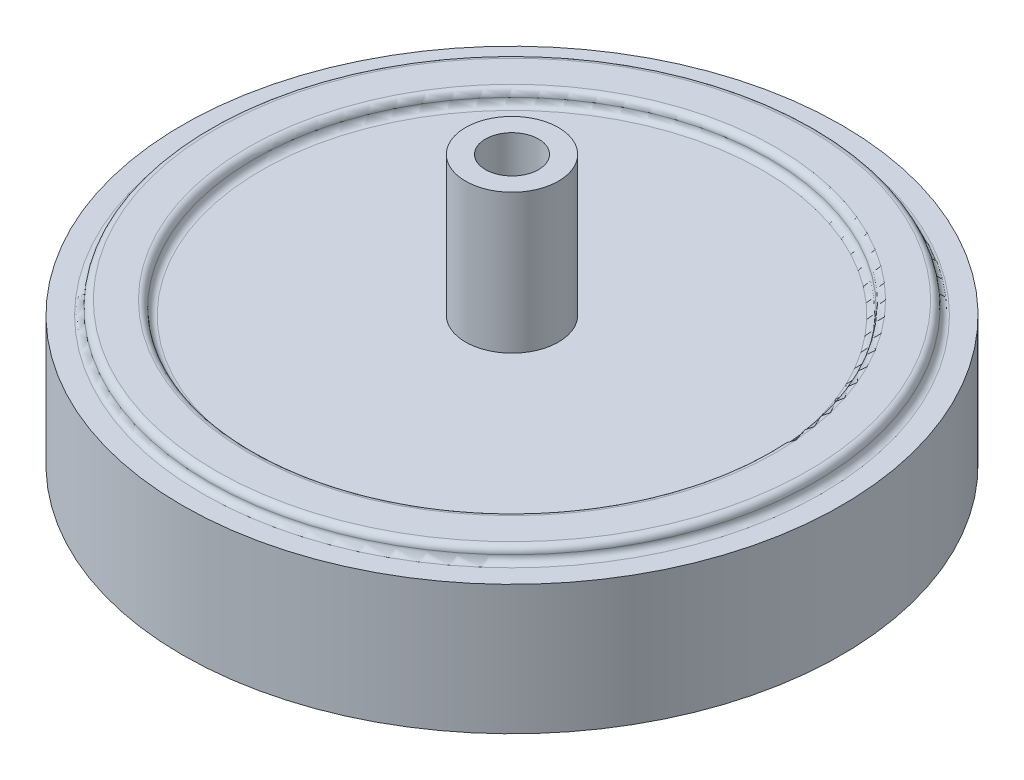
ISO-10303-21;
HEADER;
FILE_DESCRIPTION(('STEP AP214'),'2;1');
FILE_NAME('part.step','',(''),(''),'','','');
FILE_SCHEMA(('AUTOMOTIVE_DESIGN { 1 0 10303 214 1 1 1 1 }'));
ENDSEC;
DATA;
#1=APPLICATION_CONTEXT('core data for automotive mechanical design processes');
#2=APPLICATION_PROTOCOL_DEFINITION('international standard','automotive_design',2000,#1);
#3=PRODUCT_CONTEXT('',#1,'mechanical');
#4=PRODUCT('Part','Part','',(#3));
#5=PRODUCT_RELATED_PRODUCT_CATEGORY('part','',(#4));
#6=PRODUCT_DEFINITION_FORMATION('','',#4);
#7=PRODUCT_DEFINITION_CONTEXT('part definition',#1,'design');
#8=PRODUCT_DEFINITION('design','',#6,#7);
#9=PRODUCT_DEFINITION_SHAPE('','',#8);
#10=(LENGTH_UNIT() NAMED_UNIT(*) SI_UNIT(.MILLI.,.METRE.));
#11=(NAMED_UNIT(*) PLANE_ANGLE_UNIT() SI_UNIT($,.RADIAN.));
#12=(NAMED_UNIT(*) SI_UNIT($,.STERADIAN.) SOLID_ANGLE_UNIT());
#13=UNCERTAINTY_MEASURE_WITH_UNIT(LENGTH_MEASURE(1.E-05),#10,'distance_accuracy_value','');
#14=(GEOMETRIC_REPRESENTATION_CONTEXT(3) GLOBAL_UNCERTAINTY_ASSIGNED_CONTEXT((#13)) GLOBAL_UNIT_ASSIGNED_CONTEXT((#10,
#11,#12)) REPRESENTATION_CONTEXT('',''));
#15=CARTESIAN_POINT('',(0.,0.,0.));
#16=DIRECTION('',(0.,0.,1.));
#17=DIRECTION('',(1.,0.,0.));
#18=AXIS2_PLACEMENT_3D('',#15,#16,#17);
#19=CARTESIAN_POINT('',(0.,-1.5,0.));
#20=DIRECTION('',(0.,-1.,0.));
#21=DIRECTION('',(0.,0.,-1.));
#22=AXIS2_PLACEMENT_3D('',#19,#20,#21);
#23=CYLINDRICAL_SURFACE('',#22,22.);
#24=CARTESIAN_POINT('',(0.,-10.5,0.));
#25=DIRECTION('',(0.,-1.,0.));
#26=DIRECTION('',(0.,0.,-1.));
#27=AXIS2_PLACEMENT_3D('',#24,#25,#26);
#28=CIRCLE('',#27,22.);
#29=CARTESIAN_POINT('',(0.,-10.5,-22.));
#30=VERTEX_POINT('',#29);
#31=EDGE_CURVE('E173',#30,#30,#28,.F.);
#32=ORIENTED_EDGE('',*,*,#31,.F.);
#33=EDGE_LOOP('',(#32));
#34=FACE_BOUND('',#33,.T.);
#35=CARTESIAN_POINT('',(0.,-1.5,0.));
#36=DIRECTION('',(0.,-1.,0.));
#37=DIRECTION('',(0.,0.,-1.));
#38=AXIS2_PLACEMENT_3D('',#35,#36,#37);
#39=CIRCLE('',#38,22.);
#40=CARTESIAN_POINT('',(0.,-1.5,-22.));
#41=VERTEX_POINT('',#40);
#42=EDGE_CURVE('E176',#41,#41,#39,.T.);
#43=ORIENTED_EDGE('',*,*,#42,.F.);
#44=EDGE_LOOP('',(#43));
#45=FACE_BOUND('',#44,.T.);
#46=ADVANCED_FACE('F17',(#34,#45),#23,.F.);
#47=CARTESIAN_POINT('',(0.,-1.5,0.));
#48=DIRECTION('',(0.,-1.,0.));
#49=DIRECTION('',(0.,0.,-1.));
#50=AXIS2_PLACEMENT_3D('',#47,#48,#49);
#51=PLANE('',#50);
#52=CARTESIAN_POINT('',(0.,-1.5,0.));
#53=DIRECTION('',(0.,1.,0.));
#54=DIRECTION('',(0.,0.,1.));
#55=AXIS2_PLACEMENT_3D('',#52,#53,#54);
#56=CIRCLE('',#55,18.);
#57=CARTESIAN_POINT('',(0.,-1.5,18.));
#58=VERTEX_POINT('',#57);
#59=EDGE_CURVE('E170',#58,#58,#56,.F.);
#60=ORIENTED_EDGE('',*,*,#59,.F.);
#61=EDGE_LOOP('',(#60));
#62=FACE_BOUND('',#61,.T.);
#63=ORIENTED_EDGE('',*,*,#42,.T.);
#64=EDGE_LOOP('',(#63));
#65=FACE_BOUND('',#64,.T.);
#66=ADVANCED_FACE('F422',(#62,#65),#51,.T.);
#67=CARTESIAN_POINT('',(0.,-10.5,0.));
#68=DIRECTION('',(0.,-1.,0.));
#69=DIRECTION('',(0.,0.,-1.));
#70=AXIS2_PLACEMENT_3D('',#67,#68,#69);
#71=PLANE('',#70);
#72=ORIENTED_EDGE('',*,*,#31,.T.);
#73=EDGE_LOOP('',(#72));
#74=FACE_BOUND('',#73,.T.);
#75=CARTESIAN_POINT('',(0.,-10.5,0.));
#76=DIRECTION('',(0.,1.,0.));
#77=DIRECTION('',(0.,0.,1.));
#78=AXIS2_PLACEMENT_3D('',#75,#76,#77);
#79=CIRCLE('',#78,22.0259618943234);
#80=CARTESIAN_POINT('',(0.,-10.5,22.0259618943234));
#81=VERTEX_POINT('',#80);
#82=EDGE_CURVE('E167',#81,#81,#79,.T.);
#83=ORIENTED_EDGE('',*,*,#82,.F.);
#84=EDGE_LOOP('',(#83));
#85=FACE_BOUND('',#84,.T.);
#86=ADVANCED_FACE('F412',(#74,#85),#71,.T.);
#87=CARTESIAN_POINT('',(0.,-2.5,0.));
#88=DIRECTION('',(0.,1.,0.));
#89=DIRECTION('',(0.,0.,1.));
#90=AXIS2_PLACEMENT_3D('',#87,#88,#89);
#91=CYLINDRICAL_SURFACE('',#90,18.);
#92=ORIENTED_EDGE('',*,*,#59,.T.);
#93=EDGE_LOOP('',(#92));
#94=FACE_BOUND('',#93,.T.);
#95=CARTESIAN_POINT('',(0.,-2.5,0.));
#96=DIRECTION('',(0.,1.,0.));
#97=DIRECTION('',(0.,0.,1.));
#98=AXIS2_PLACEMENT_3D('',#95,#96,#97);
#99=CIRCLE('',#98,18.);
#100=CARTESIAN_POINT('',(0.,-2.5,18.));
#101=VERTEX_POINT('',#100);
#102=EDGE_CURVE('E164',#101,#101,#99,.F.);
#103=ORIENTED_EDGE('',*,*,#102,.F.);
#104=EDGE_LOOP('',(#103));
#105=FACE_BOUND('',#104,.T.);
#106=ADVANCED_FACE('F402',(#94,#105),#91,.T.);
#107=CARTESIAN_POINT('',(0.,-9.75,0.));
#108=DIRECTION('',(0.,1.,0.));
#109=DIRECTION('',(0.,0.,1.));
#110=AXIS2_PLACEMENT_3D('',#107,#108,#109);
#111=CONICAL_SURFACE('',#110,24.825,1.30899693899574);
#112=ORIENTED_EDGE('',*,*,#82,.T.);
#113=EDGE_LOOP('',(#112));
#114=FACE_BOUND('',#113,.T.);
#115=CARTESIAN_POINT('',(0.,-9.75,0.));
#116=DIRECTION('',(0.,1.,0.));
#117=DIRECTION('',(0.,0.,1.));
#118=AXIS2_PLACEMENT_3D('',#115,#116,#117);
#119=CIRCLE('',#118,24.825);
#120=CARTESIAN_POINT('',(0.,-9.75,24.825));
#121=VERTEX_POINT('',#120);
#122=EDGE_CURVE('E101',#121,#121,#119,.T.);
#123=ORIENTED_EDGE('',*,*,#122,.F.);
#124=EDGE_LOOP('',(#123));
#125=FACE_BOUND('',#124,.T.);
#126=ADVANCED_FACE('F392',(#114,#125),#111,.T.);
#127=CARTESIAN_POINT('',(0.,-2.5,0.));
#128=DIRECTION('',(0.,-1.,0.));
#129=DIRECTION('',(0.,0.,-1.));
#130=AXIS2_PLACEMENT_3D('',#127,#128,#129);
#131=PLANE('',#130);
#132=CARTESIAN_POINT('',(0.,-2.5,0.));
#133=DIRECTION('',(0.,1.,0.));
#134=DIRECTION('',(0.,0.,1.));
#135=AXIS2_PLACEMENT_3D('',#132,#133,#134);
#136=CIRCLE('',#135,5.);
#137=CARTESIAN_POINT('',(0.,-2.5,5.));
#138=VERTEX_POINT('',#137);
#139=EDGE_CURVE('E161',#138,#138,#136,.F.);
#140=ORIENTED_EDGE('',*,*,#139,.F.);
#141=EDGE_LOOP('',(#140));
#142=FACE_BOUND('',#141,.T.);
#143=ORIENTED_EDGE('',*,*,#102,.T.);
#144=EDGE_LOOP('',(#143));
#145=FACE_BOUND('',#144,.T.);
#146=ADVANCED_FACE('F383',(#142,#145),#131,.T.);
#147=CARTESIAN_POINT('',(0.,-10.5,0.));
#148=DIRECTION('',(0.,1.,0.));
#149=DIRECTION('',(0.,0.,1.));
#150=AXIS2_PLACEMENT_3D('',#147,#148,#149);
#151=CYLINDRICAL_SURFACE('',#150,24.825);
#152=ORIENTED_EDGE('',*,*,#122,.T.);
#153=EDGE_LOOP('',(#152));
#154=FACE_BOUND('',#153,.T.);
#155=CARTESIAN_POINT('',(0.,0.,0.));
#156=DIRECTION('',(0.,1.,0.));
#157=DIRECTION('',(0.,0.,1.));
#158=AXIS2_PLACEMENT_3D('',#155,#156,#157);
#159=CIRCLE('',#158,24.825);
#160=CARTESIAN_POINT('',(0.,0.,24.825));
#161=VERTEX_POINT('',#160);
#162=EDGE_CURVE('E158',#161,#161,#159,.F.);
#163=ORIENTED_EDGE('',*,*,#162,.T.);
#164=EDGE_LOOP('',(#163));
#165=FACE_BOUND('',#164,.T.);
#166=ADVANCED_FACE('F374',(#154,#165),#151,.T.);
#167=CARTESIAN_POINT('',(0.,-6.65,0.));
#168=DIRECTION('',(0.,1.,0.));
#169=DIRECTION('',(0.,0.,1.));
#170=AXIS2_PLACEMENT_3D('',#167,#168,#169);
#171=CYLINDRICAL_SURFACE('',#170,5.);
#172=ORIENTED_EDGE('',*,*,#139,.T.);
#173=EDGE_LOOP('',(#172));
#174=FACE_BOUND('',#173,.T.);
#175=CARTESIAN_POINT('',(0.,-6.65,0.));
#176=DIRECTION('',(0.,1.,0.));
#177=DIRECTION('',(0.,0.,1.));
#178=AXIS2_PLACEMENT_3D('',#175,#176,#177);
#179=CIRCLE('',#178,5.);
#180=CARTESIAN_POINT('',(0.,-6.65,5.));
#181=VERTEX_POINT('',#180);
#182=EDGE_CURVE('E63',#181,#181,#179,.F.);
#183=ORIENTED_EDGE('',*,*,#182,.F.);
#184=EDGE_LOOP('',(#183));
#185=FACE_BOUND('',#184,.T.);
#186=ADVANCED_FACE('F86',(#174,#185),#171,.T.);
#187=CARTESIAN_POINT('',(0.,0.,0.));
#188=DIRECTION('',(0.,-1.,0.));
#189=DIRECTION('',(0.,0.,-1.));
#190=AXIS2_PLACEMENT_3D('',#187,#188,#189);
#191=PLANE('',#190);
#192=ORIENTED_EDGE('',*,*,#162,.F.);
#193=EDGE_LOOP('',(#192));
#194=FACE_BOUND('',#193,.T.);
#195=CARTESIAN_POINT('',(0.,0.,0.));
#196=DIRECTION('',(0.,1.,0.));
#197=DIRECTION('',(0.,0.,-1.));
#198=AXIS2_PLACEMENT_3D('',#195,#196,#197);
#199=CIRCLE('',#198,23.3);
#200=CARTESIAN_POINT('',(0.,0.,23.3));
#201=VERTEX_POINT('',#200);
#202=CARTESIAN_POINT('',(0.,0.,-23.3));
#203=VERTEX_POINT('',#202);
#204=EDGE_CURVE('E61',#201,#203,#199,.F.);
#205=ORIENTED_EDGE('',*,*,#204,.T.);
#206=CARTESIAN_POINT('',(0.,0.,0.));
#207=DIRECTION('',(0.,1.,0.));
#208=DIRECTION('',(0.,0.,1.));
#209=AXIS2_PLACEMENT_3D('',#206,#207,#208);
#210=CIRCLE('',#209,23.3);
#211=EDGE_CURVE('E56',#203,#201,#210,.F.);
#212=ORIENTED_EDGE('',*,*,#211,.T.);
#213=EDGE_LOOP('',(#205,#212));
#214=FACE_BOUND('',#213,.T.);
#215=ADVANCED_FACE('F66',(#194,#214),#191,.F.);
#216=CARTESIAN_POINT('',(0.,-6.65,0.));
#217=DIRECTION('',(0.,-1.,0.));
#218=DIRECTION('',(0.,0.,-1.));
#219=AXIS2_PLACEMENT_3D('',#216,#217,#218);
#220=PLANE('',#219);
#221=CARTESIAN_POINT('',(0.,-6.65,0.));
#222=DIRECTION('',(0.,1.,0.));
#223=DIRECTION('',(0.,0.,1.));
#224=AXIS2_PLACEMENT_3D('',#221,#222,#223);
#225=CIRCLE('',#224,3.425);
#226=CARTESIAN_POINT('',(0.,-6.65,3.425));
#227=VERTEX_POINT('',#226);
#228=EDGE_CURVE('E67',#227,#227,#225,.F.);
#229=ORIENTED_EDGE('',*,*,#228,.F.);
#230=EDGE_LOOP('',(#229));
#231=FACE_BOUND('',#230,.T.);
#232=ORIENTED_EDGE('',*,*,#182,.T.);
#233=EDGE_LOOP('',(#232));
#234=FACE_BOUND('',#233,.T.);
#235=ADVANCED_FACE('F85',(#231,#234),#220,.T.);
#236=CARTESIAN_POINT('',(0.,0.5,0.));
#237=DIRECTION('',(0.,-1.,0.));
#238=DIRECTION('',(0.,0.,-1.));
#239=AXIS2_PLACEMENT_3D('',#236,#237,#238);
#240=TOROIDAL_SURFACE('',#239,23.3,0.5);
#241=CARTESIAN_POINT('',(0.,0.5,0.));
#242=DIRECTION('',(0.,1.,0.));
#243=DIRECTION('',(0.,0.,1.));
#244=AXIS2_PLACEMENT_3D('',#241,#242,#243);
#245=CIRCLE('',#244,22.8);
#246=CARTESIAN_POINT('',(0.,0.5,22.8));
#247=VERTEX_POINT('',#246);
#248=EDGE_CURVE('E139',#247,#247,#245,.T.);
#249=ORIENTED_EDGE('',*,*,#248,.F.);
#250=EDGE_LOOP('',(#249));
#251=FACE_BOUND('',#250,.T.);
#252=ORIENTED_EDGE('',*,*,#204,.F.);
#253=ORIENTED_EDGE('',*,*,#211,.F.);
#254=EDGE_LOOP('',(#252,#253));
#255=FACE_BOUND('',#254,.T.);
#256=ADVANCED_FACE('F60',(#251,#255),#240,.F.);
#257=CARTESIAN_POINT('',(0.,-14.65,0.));
#258=DIRECTION('',(0.,1.,0.));
#259=DIRECTION('',(0.,0.,1.));
#260=AXIS2_PLACEMENT_3D('',#257,#258,#259);
#261=CYLINDRICAL_SURFACE('',#260,3.425);
#262=ORIENTED_EDGE('',*,*,#228,.T.);
#263=EDGE_LOOP('',(#262));
#264=FACE_BOUND('',#263,.T.);
#265=CARTESIAN_POINT('',(0.,-14.65,0.));
#266=DIRECTION('',(0.,1.,0.));
#267=DIRECTION('',(0.,0.,1.));
#268=AXIS2_PLACEMENT_3D('',#265,#266,#267);
#269=CIRCLE('',#268,3.425);
#270=CARTESIAN_POINT('',(0.,-14.65,3.425));
#271=VERTEX_POINT('',#270);
#272=EDGE_CURVE('E146',#271,#271,#269,.F.);
#273=ORIENTED_EDGE('',*,*,#272,.F.);
#274=EDGE_LOOP('',(#273));
#275=FACE_BOUND('',#274,.T.);
#276=ADVANCED_FACE('F110',(#264,#275),#261,.T.);
#277=CARTESIAN_POINT('',(0.,0.5,0.));
#278=DIRECTION('',(0.,1.,0.));
#279=DIRECTION('',(0.,0.,1.));
#280=AXIS2_PLACEMENT_3D('',#277,#278,#279);
#281=TOROIDAL_SURFACE('',#280,22.3,0.5);
#282=ORIENTED_EDGE('',*,*,#248,.T.);
#283=EDGE_LOOP('',(#282));
#284=FACE_BOUND('',#283,.T.);
#285=CARTESIAN_POINT('',(0.,1.,0.));
#286=DIRECTION('',(0.,-1.,0.));
#287=DIRECTION('',(0.,0.,1.));
#288=AXIS2_PLACEMENT_3D('',#285,#286,#287);
#289=CIRCLE('',#288,22.3);
#290=CARTESIAN_POINT('',(0.,1.,-22.3));
#291=VERTEX_POINT('',#290);
#292=CARTESIAN_POINT('',(0.,1.,22.3));
#293=VERTEX_POINT('',#292);
#294=EDGE_CURVE('E136',#291,#293,#289,.F.);
#295=ORIENTED_EDGE('',*,*,#294,.F.);
#296=CARTESIAN_POINT('',(0.,1.,0.));
#297=DIRECTION('',(0.,-1.,0.));
#298=DIRECTION('',(0.,0.,-1.));
#299=AXIS2_PLACEMENT_3D('',#296,#297,#298);
#300=CIRCLE('',#299,22.3);
#301=EDGE_CURVE('E149',#293,#291,#300,.F.);
#302=ORIENTED_EDGE('',*,*,#301,.F.);
#303=EDGE_LOOP('',(#295,#302));
#304=FACE_BOUND('',#303,.T.);
#305=ADVANCED_FACE('F115',(#284,#304),#281,.T.);
#306=CARTESIAN_POINT('',(0.,-14.65,0.));
#307=DIRECTION('',(0.,-1.,0.));
#308=DIRECTION('',(0.,0.,-1.));
#309=AXIS2_PLACEMENT_3D('',#306,#307,#308);
#310=PLANE('',#309);
#311=ORIENTED_EDGE('',*,*,#272,.T.);
#312=EDGE_LOOP('',(#311));
#313=FACE_BOUND('',#312,.T.);
#314=CARTESIAN_POINT('',(0.,-14.65,0.));
#315=DIRECTION('',(0.,-1.,0.));
#316=DIRECTION('',(0.,0.,-1.));
#317=AXIS2_PLACEMENT_3D('',#314,#315,#316);
#318=CIRCLE('',#317,2.);
#319=CARTESIAN_POINT('',(0.,-14.65,-2.));
#320=VERTEX_POINT('',#319);
#321=EDGE_CURVE('E244',#320,#320,#318,.F.);
#322=ORIENTED_EDGE('',*,*,#321,.T.);
#323=EDGE_LOOP('',(#322));
#324=FACE_BOUND('',#323,.T.);
#325=ADVANCED_FACE('F121',(#313,#324),#310,.T.);
#326=CARTESIAN_POINT('',(0.,1.,0.));
#327=DIRECTION('',(0.,1.,0.));
#328=DIRECTION('',(0.,0.,1.));
#329=AXIS2_PLACEMENT_3D('',#326,#327,#328);
#330=PLANE('',#329);
#331=ORIENTED_EDGE('',*,*,#301,.T.);
#332=ORIENTED_EDGE('',*,*,#294,.T.);
#333=EDGE_LOOP('',(#331,#332));
#334=FACE_BOUND('',#333,.T.);
#335=CARTESIAN_POINT('',(0.,1.,0.));
#336=DIRECTION('',(0.,1.,0.));
#337=DIRECTION('',(0.,0.,-1.));
#338=AXIS2_PLACEMENT_3D('',#335,#336,#337);
#339=CIRCLE('',#338,19.9);
#340=CARTESIAN_POINT('',(0.,1.,-19.9));
#341=VERTEX_POINT('',#340);
#342=CARTESIAN_POINT('',(0.,1.,19.9));
#343=VERTEX_POINT('',#342);
#344=EDGE_CURVE('E250',#341,#343,#339,.T.);
#345=ORIENTED_EDGE('',*,*,#344,.F.);
#346=CARTESIAN_POINT('',(0.,1.,0.));
#347=DIRECTION('',(0.,1.,0.));
#348=DIRECTION('',(0.,0.,1.));
#349=AXIS2_PLACEMENT_3D('',#346,#347,#348);
#350=CIRCLE('',#349,19.9);
#351=EDGE_CURVE('E247',#343,#341,#350,.T.);
#352=ORIENTED_EDGE('',*,*,#351,.F.);
#353=EDGE_LOOP('',(#345,#352));
#354=FACE_BOUND('',#353,.T.);
#355=ADVANCED_FACE('F318',(#334,#354),#330,.T.);
#356=CARTESIAN_POINT('',(0.,10.5,0.));
#357=DIRECTION('',(0.,-1.,0.));
#358=DIRECTION('',(0.,0.,-1.));
#359=AXIS2_PLACEMENT_3D('',#356,#357,#358);
#360=CYLINDRICAL_SURFACE('',#359,2.);
#361=CARTESIAN_POINT('',(0.,10.5,0.));
#362=DIRECTION('',(0.,-1.,0.));
#363=DIRECTION('',(0.,0.,-1.));
#364=AXIS2_PLACEMENT_3D('',#361,#362,#363);
#365=CIRCLE('',#364,2.);
#366=CARTESIAN_POINT('',(0.,10.5,-2.));
#367=VERTEX_POINT('',#366);
#368=EDGE_CURVE('E252',#367,#367,#365,.T.);
#369=ORIENTED_EDGE('',*,*,#368,.F.);
#370=EDGE_LOOP('',(#369));
#371=FACE_BOUND('',#370,.T.);
#372=ORIENTED_EDGE('',*,*,#321,.F.);
#373=EDGE_LOOP('',(#372));
#374=FACE_BOUND('',#373,.T.);
#375=ADVANCED_FACE('F224',(#371,#374),#360,.F.);
#376=CARTESIAN_POINT('',(0.,0.5,0.));
#377=DIRECTION('',(0.,1.,0.));
#378=DIRECTION('',(0.,0.,1.));
#379=AXIS2_PLACEMENT_3D('',#376,#377,#378);
#380=TOROIDAL_SURFACE('',#379,19.9,0.5);
#381=ORIENTED_EDGE('',*,*,#351,.T.);
#382=ORIENTED_EDGE('',*,*,#344,.T.);
#383=EDGE_LOOP('',(#381,#382));
#384=FACE_BOUND('',#383,.T.);
#385=CARTESIAN_POINT('',(0.,0.5,0.));
#386=DIRECTION('',(0.,-1.,0.));
#387=DIRECTION('',(0.,0.,-1.));
#388=AXIS2_PLACEMENT_3D('',#385,#386,#387);
#389=CIRCLE('',#388,19.4);
#390=CARTESIAN_POINT('',(0.,0.5,-19.4));
#391=VERTEX_POINT('',#390);
#392=EDGE_CURVE('E218',#391,#391,#389,.T.);
#393=ORIENTED_EDGE('',*,*,#392,.T.);
#394=EDGE_LOOP('',(#393));
#395=FACE_BOUND('',#394,.T.);
#396=ADVANCED_FACE('F220',(#384,#395),#380,.T.);
#397=CARTESIAN_POINT('',(0.,10.5,0.));
#398=DIRECTION('',(0.,1.,0.));
#399=DIRECTION('',(0.,0.,1.));
#400=AXIS2_PLACEMENT_3D('',#397,#398,#399);
#401=PLANE('',#400);
#402=ORIENTED_EDGE('',*,*,#368,.T.);
#403=EDGE_LOOP('',(#402));
#404=FACE_BOUND('',#403,.T.);
#405=CARTESIAN_POINT('',(0.,10.5,0.));
#406=DIRECTION('',(0.,-1.,0.));
#407=DIRECTION('',(0.,0.,-1.));
#408=AXIS2_PLACEMENT_3D('',#405,#406,#407);
#409=CIRCLE('',#408,3.5);
#410=CARTESIAN_POINT('',(0.,10.5,-3.5));
#411=VERTEX_POINT('',#410);
#412=EDGE_CURVE('E255',#411,#411,#409,.T.);
#413=ORIENTED_EDGE('',*,*,#412,.F.);
#414=EDGE_LOOP('',(#413));
#415=FACE_BOUND('',#414,.T.);
#416=ADVANCED_FACE('F199',(#404,#415),#401,.T.);
#417=CARTESIAN_POINT('',(0.,0.5,0.));
#418=DIRECTION('',(0.,-1.,0.));
#419=DIRECTION('',(0.,0.,-1.));
#420=AXIS2_PLACEMENT_3D('',#417,#418,#419);
#421=TOROIDAL_SURFACE('',#420,18.9,0.5);
#422=CARTESIAN_POINT('',(0.,0.,0.));
#423=DIRECTION('',(0.,-1.,0.));
#424=DIRECTION('',(0.,0.,1.));
#425=AXIS2_PLACEMENT_3D('',#422,#423,#424);
#426=CIRCLE('',#425,18.9);
#427=CARTESIAN_POINT('',(0.,0.,18.9));
#428=VERTEX_POINT('',#427);
#429=CARTESIAN_POINT('',(0.,0.,-18.9));
#430=VERTEX_POINT('',#429);
#431=EDGE_CURVE('E28',#428,#430,#426,.T.);
#432=ORIENTED_EDGE('',*,*,#431,.T.);
#433=CARTESIAN_POINT('',(0.,0.,0.));
#434=DIRECTION('',(0.,-1.,0.));
#435=DIRECTION('',(0.,0.,-1.));
#436=AXIS2_PLACEMENT_3D('',#433,#434,#435);
#437=CIRCLE('',#436,18.9);
#438=EDGE_CURVE('E181',#430,#428,#437,.T.);
#439=ORIENTED_EDGE('',*,*,#438,.T.);
#440=EDGE_LOOP('',(#432,#439));
#441=FACE_BOUND('',#440,.T.);
#442=ORIENTED_EDGE('',*,*,#392,.F.);
#443=EDGE_LOOP('',(#442));
#444=FACE_BOUND('',#443,.T.);
#445=ADVANCED_FACE('F187',(#441,#444),#421,.F.);
#446=CARTESIAN_POINT('',(0.,10.5,0.));
#447=DIRECTION('',(0.,-1.,0.));
#448=DIRECTION('',(0.,0.,-1.));
#449=AXIS2_PLACEMENT_3D('',#446,#447,#448);
#450=CYLINDRICAL_SURFACE('',#449,3.5);
#451=CARTESIAN_POINT('',(0.,0.,0.));
#452=DIRECTION('',(0.,-1.,0.));
#453=DIRECTION('',(0.,0.,-1.));
#454=AXIS2_PLACEMENT_3D('',#451,#452,#453);
#455=CIRCLE('',#454,3.5);
#456=CARTESIAN_POINT('',(0.,0.,-3.5));
#457=VERTEX_POINT('',#456);
#458=EDGE_CURVE('E11',#457,#457,#455,.F.);
#459=ORIENTED_EDGE('',*,*,#458,.T.);
#460=EDGE_LOOP('',(#459));
#461=FACE_BOUND('',#460,.T.);
#462=ORIENTED_EDGE('',*,*,#412,.T.);
#463=EDGE_LOOP('',(#462));
#464=FACE_BOUND('',#463,.T.);
#465=ADVANCED_FACE('F198',(#461,#464),#450,.T.);
#466=CARTESIAN_POINT('',(0.,0.,0.));
#467=DIRECTION('',(0.,-1.,0.));
#468=DIRECTION('',(0.,0.,-1.));
#469=AXIS2_PLACEMENT_3D('',#466,#467,#468);
#470=PLANE('',#469);
#471=ORIENTED_EDGE('',*,*,#458,.F.);
#472=EDGE_LOOP('',(#471));
#473=FACE_BOUND('',#472,.T.);
#474=ORIENTED_EDGE('',*,*,#438,.F.);
#475=ORIENTED_EDGE('',*,*,#431,.F.);
#476=EDGE_LOOP('',(#474,#475));
#477=FACE_BOUND('',#476,.T.);
#478=ADVANCED_FACE('F269',(#473,#477),#470,.F.);
#479=CLOSED_SHELL('',(#46,#66,#86,#106,#126,#146,#166,#186,#215,#235,#256,#276,#305,#325,#355,
#375,#396,#416,#445,#465,#478));
#480=MANIFOLD_SOLID_BREP('B1',#479);
#481=ADVANCED_BREP_SHAPE_REPRESENTATION('',(#18,#480),#14);
#482=SHAPE_DEFINITION_REPRESENTATION(#9,#481);
ENDSEC;
END-ISO-10303-21;
